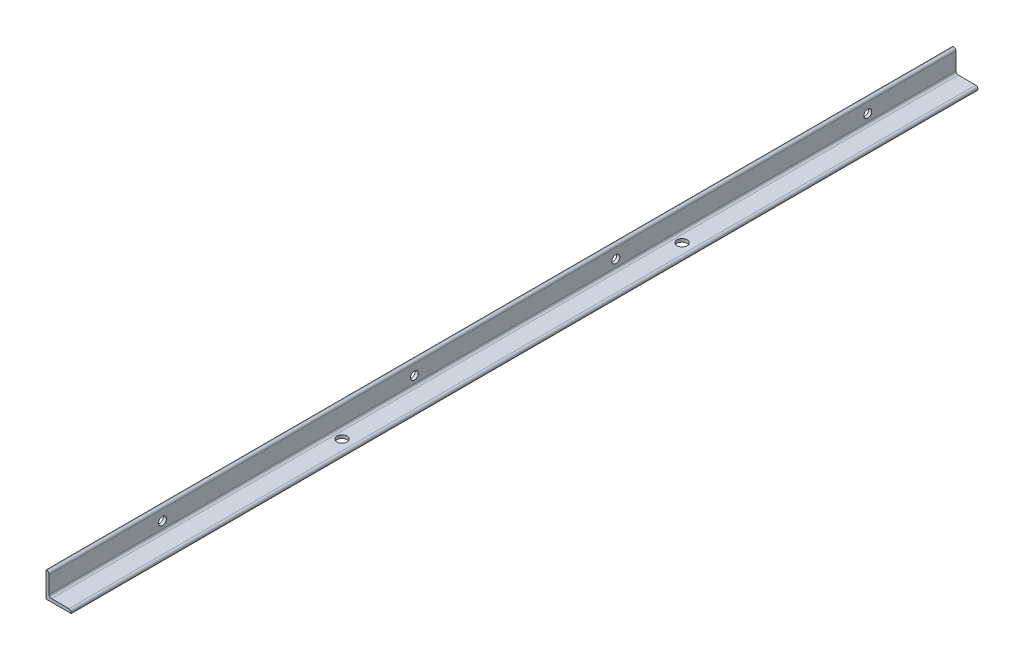
ISO-10303-21;
HEADER;
FILE_DESCRIPTION(('STEP AP214'),'2;1');
FILE_NAME('part.step','',(''),(''),'','','');
FILE_SCHEMA(('AUTOMOTIVE_DESIGN { 1 0 10303 214 1 1 1 1 }'));
ENDSEC;
DATA;
#1=APPLICATION_CONTEXT('core data for automotive mechanical design processes');
#2=APPLICATION_PROTOCOL_DEFINITION('international standard','automotive_design',2000,#1);
#3=PRODUCT_CONTEXT('',#1,'mechanical');
#4=PRODUCT('Part','Part','',(#3));
#5=PRODUCT_RELATED_PRODUCT_CATEGORY('part','',(#4));
#6=PRODUCT_DEFINITION_FORMATION('','',#4);
#7=PRODUCT_DEFINITION_CONTEXT('part definition',#1,'design');
#8=PRODUCT_DEFINITION('design','',#6,#7);
#9=PRODUCT_DEFINITION_SHAPE('','',#8);
#10=(LENGTH_UNIT() NAMED_UNIT(*) SI_UNIT(.MILLI.,.METRE.));
#11=(NAMED_UNIT(*) PLANE_ANGLE_UNIT() SI_UNIT($,.RADIAN.));
#12=(NAMED_UNIT(*) SI_UNIT($,.STERADIAN.) SOLID_ANGLE_UNIT());
#13=UNCERTAINTY_MEASURE_WITH_UNIT(LENGTH_MEASURE(1.E-05),#10,'distance_accuracy_value','');
#14=(GEOMETRIC_REPRESENTATION_CONTEXT(3) GLOBAL_UNCERTAINTY_ASSIGNED_CONTEXT((#13)) GLOBAL_UNIT_ASSIGNED_CONTEXT((#10,
#11,#12)) REPRESENTATION_CONTEXT('',''));
#15=CARTESIAN_POINT('',(0.,0.,0.));
#16=DIRECTION('',(0.,0.,1.));
#17=DIRECTION('',(1.,0.,0.));
#18=AXIS2_PLACEMENT_3D('',#15,#16,#17);
#19=CARTESIAN_POINT('',(0.,0.,914.4));
#20=DIRECTION('',(1.,0.,0.));
#21=DIRECTION('',(0.,1.,0.));
#22=AXIS2_PLACEMENT_3D('',#19,#20,#21);
#23=PLANE('',#22);
#24=CARTESIAN_POINT('',(0.,25.4,-736.6));
#25=DIRECTION('',(-1.,0.,0.));
#26=DIRECTION('',(0.,0.,1.));
#27=AXIS2_PLACEMENT_3D('',#24,#25,#26);
#28=CIRCLE('',#27,7.9375);
#29=CARTESIAN_POINT('',(0.,25.4,-728.6625));
#30=VERTEX_POINT('',#29);
#31=EDGE_CURVE('E210',#30,#30,#28,.T.);
#32=ORIENTED_EDGE('',*,*,#31,.F.);
#33=EDGE_LOOP('',(#32));
#34=FACE_BOUND('',#33,.T.);
#35=CARTESIAN_POINT('',(0.,25.4,-228.6));
#36=DIRECTION('',(-1.,0.,0.));
#37=DIRECTION('',(0.,0.,1.));
#38=AXIS2_PLACEMENT_3D('',#35,#36,#37);
#39=CIRCLE('',#38,7.9375);
#40=CARTESIAN_POINT('',(0.,25.4,-220.6625));
#41=VERTEX_POINT('',#40);
#42=EDGE_CURVE('E204',#41,#41,#39,.T.);
#43=ORIENTED_EDGE('',*,*,#42,.F.);
#44=EDGE_LOOP('',(#43));
#45=FACE_BOUND('',#44,.T.);
#46=CARTESIAN_POINT('',(0.,25.4,177.8));
#47=DIRECTION('',(-1.,0.,0.));
#48=DIRECTION('',(0.,0.,1.));
#49=AXIS2_PLACEMENT_3D('',#46,#47,#48);
#50=CIRCLE('',#49,7.9375);
#51=CARTESIAN_POINT('',(0.,25.4,185.7375));
#52=VERTEX_POINT('',#51);
#53=EDGE_CURVE('E198',#52,#52,#50,.T.);
#54=ORIENTED_EDGE('',*,*,#53,.F.);
#55=EDGE_LOOP('',(#54));
#56=FACE_BOUND('',#55,.T.);
#57=DIRECTION('',(0.,-1.,0.));
#58=VECTOR('',#57,1.);
#59=CARTESIAN_POINT('',(0.,0.,-914.4));
#60=LINE('',#59,#58);
#61=CARTESIAN_POINT('',(0.,50.8,-914.4));
#62=VERTEX_POINT('',#61);
#63=CARTESIAN_POINT('',(0.,0.,-914.4));
#64=VERTEX_POINT('',#63);
#65=EDGE_CURVE('E72',#62,#64,#60,.T.);
#66=ORIENTED_EDGE('',*,*,#65,.T.);
#67=DIRECTION('',(0.,0.,-1.));
#68=VECTOR('',#67,1.);
#69=CARTESIAN_POINT('',(0.,0.,914.4));
#70=LINE('',#69,#68);
#71=CARTESIAN_POINT('',(0.,0.,914.4));
#72=VERTEX_POINT('',#71);
#73=EDGE_CURVE('E116',#72,#64,#70,.T.);
#74=ORIENTED_EDGE('',*,*,#73,.F.);
#75=DIRECTION('',(0.,-1.,0.));
#76=VECTOR('',#75,1.);
#77=CARTESIAN_POINT('',(0.,0.,914.4));
#78=LINE('',#77,#76);
#79=CARTESIAN_POINT('',(0.,50.8,914.4));
#80=VERTEX_POINT('',#79);
#81=EDGE_CURVE('E34',#80,#72,#78,.T.);
#82=ORIENTED_EDGE('',*,*,#81,.F.);
#83=DIRECTION('',(0.,0.,-1.));
#84=VECTOR('',#83,1.);
#85=CARTESIAN_POINT('',(0.,50.8,914.4));
#86=LINE('',#85,#84);
#87=EDGE_CURVE('E112',#80,#62,#86,.T.);
#88=ORIENTED_EDGE('',*,*,#87,.T.);
#89=EDGE_LOOP('',(#66,#74,#82,#88));
#90=FACE_BOUND('',#89,.T.);
#91=CARTESIAN_POINT('',(0.,25.4,685.8));
#92=DIRECTION('',(-1.,0.,0.));
#93=DIRECTION('',(0.,0.,1.));
#94=AXIS2_PLACEMENT_3D('',#91,#92,#93);
#95=CIRCLE('',#94,7.9375);
#96=CARTESIAN_POINT('',(0.,25.4,693.7375));
#97=VERTEX_POINT('',#96);
#98=EDGE_CURVE('E192',#97,#97,#95,.T.);
#99=ORIENTED_EDGE('',*,*,#98,.F.);
#100=EDGE_LOOP('',(#99));
#101=FACE_BOUND('',#100,.T.);
#102=ADVANCED_FACE('F17',(#34,#45,#56,#90,#101),#23,.F.);
#103=CARTESIAN_POINT('',(50.8,0.,914.4));
#104=DIRECTION('',(0.,1.,0.));
#105=DIRECTION('',(0.,0.,1.));
#106=AXIS2_PLACEMENT_3D('',#103,#104,#105);
#107=PLANE('',#106);
#108=CARTESIAN_POINT('',(25.4,0.,342.9));
#109=DIRECTION('',(0.,-1.,0.));
#110=DIRECTION('',(0.,0.,-1.));
#111=AXIS2_PLACEMENT_3D('',#108,#109,#110);
#112=CIRCLE('',#111,10.31875);
#113=CARTESIAN_POINT('',(25.4,0.,332.58125));
#114=VERTEX_POINT('',#113);
#115=EDGE_CURVE('E180',#114,#114,#112,.T.);
#116=ORIENTED_EDGE('',*,*,#115,.F.);
#117=EDGE_LOOP('',(#116));
#118=FACE_BOUND('',#117,.T.);
#119=DIRECTION('',(1.,0.,0.));
#120=VECTOR('',#119,1.);
#121=CARTESIAN_POINT('',(50.8,0.,-914.4));
#122=LINE('',#121,#120);
#123=CARTESIAN_POINT('',(50.8,0.,-914.4));
#124=VERTEX_POINT('',#123);
#125=EDGE_CURVE('E120',#64,#124,#122,.T.);
#126=ORIENTED_EDGE('',*,*,#125,.T.);
#127=DIRECTION('',(0.,0.,-1.));
#128=VECTOR('',#127,1.);
#129=CARTESIAN_POINT('',(50.8,0.,914.4));
#130=LINE('',#129,#128);
#131=CARTESIAN_POINT('',(50.8,0.,914.4));
#132=VERTEX_POINT('',#131);
#133=EDGE_CURVE('E11',#132,#124,#130,.T.);
#134=ORIENTED_EDGE('',*,*,#133,.F.);
#135=DIRECTION('',(1.,0.,0.));
#136=VECTOR('',#135,1.);
#137=CARTESIAN_POINT('',(50.8,0.,914.4));
#138=LINE('',#137,#136);
#139=EDGE_CURVE('E137',#72,#132,#138,.T.);
#140=ORIENTED_EDGE('',*,*,#139,.F.);
#141=ORIENTED_EDGE('',*,*,#73,.T.);
#142=EDGE_LOOP('',(#126,#134,#140,#141));
#143=FACE_BOUND('',#142,.T.);
#144=CARTESIAN_POINT('',(25.4,0.,-342.9));
#145=DIRECTION('',(0.,-1.,0.));
#146=DIRECTION('',(0.,0.,-1.));
#147=AXIS2_PLACEMENT_3D('',#144,#145,#146);
#148=CIRCLE('',#147,10.31875);
#149=CARTESIAN_POINT('',(25.4,0.,-353.21875));
#150=VERTEX_POINT('',#149);
#151=EDGE_CURVE('E186',#150,#150,#148,.T.);
#152=ORIENTED_EDGE('',*,*,#151,.F.);
#153=EDGE_LOOP('',(#152));
#154=FACE_BOUND('',#153,.T.);
#155=ADVANCED_FACE('F19',(#118,#143,#154),#107,.F.);
#156=CARTESIAN_POINT('',(50.8,1.59258,914.4));
#157=DIRECTION('',(-1.,0.,0.));
#158=DIRECTION('',(0.,0.,1.));
#159=AXIS2_PLACEMENT_3D('',#156,#157,#158);
#160=PLANE('',#159);
#161=DIRECTION('',(0.,1.,0.));
#162=VECTOR('',#161,1.);
#163=CARTESIAN_POINT('',(50.8,1.59258,-914.4));
#164=LINE('',#163,#162);
#165=CARTESIAN_POINT('',(50.8,1.59258,-914.4));
#166=VERTEX_POINT('',#165);
#167=EDGE_CURVE('E123',#124,#166,#164,.T.);
#168=ORIENTED_EDGE('',*,*,#167,.T.);
#169=DIRECTION('',(0.,0.,-1.));
#170=VECTOR('',#169,1.);
#171=CARTESIAN_POINT('',(50.8,1.59258,914.4));
#172=LINE('',#171,#170);
#173=CARTESIAN_POINT('',(50.8,1.59258,914.4));
#174=VERTEX_POINT('',#173);
#175=EDGE_CURVE('E26',#174,#166,#172,.T.);
#176=ORIENTED_EDGE('',*,*,#175,.F.);
#177=DIRECTION('',(0.,1.,0.));
#178=VECTOR('',#177,1.);
#179=CARTESIAN_POINT('',(50.8,1.59258,914.4));
#180=LINE('',#179,#178);
#181=EDGE_CURVE('E80',#132,#174,#180,.T.);
#182=ORIENTED_EDGE('',*,*,#181,.F.);
#183=ORIENTED_EDGE('',*,*,#133,.T.);
#184=EDGE_LOOP('',(#168,#176,#182,#183));
#185=FACE_BOUND('',#184,.T.);
#186=ADVANCED_FACE('F267',(#185),#160,.F.);
#187=CARTESIAN_POINT('',(46.04258,1.59258,914.4));
#188=DIRECTION('',(0.,0.,-1.));
#189=DIRECTION('',(-1.,0.,0.));
#190=AXIS2_PLACEMENT_3D('',#187,#188,#189);
#191=CYLINDRICAL_SURFACE('',#190,4.75742);
#192=CARTESIAN_POINT('',(46.04258,1.59258,-914.4));
#193=DIRECTION('',(0.,0.,1.));
#194=DIRECTION('',(1.,0.,0.));
#195=AXIS2_PLACEMENT_3D('',#192,#193,#194);
#196=CIRCLE('',#195,4.75742);
#197=CARTESIAN_POINT('',(46.04258,6.35,-914.4));
#198=VERTEX_POINT('',#197);
#199=EDGE_CURVE('E126',#166,#198,#196,.T.);
#200=ORIENTED_EDGE('',*,*,#199,.T.);
#201=DIRECTION('',(0.,0.,-1.));
#202=VECTOR('',#201,1.);
#203=CARTESIAN_POINT('',(46.04258,6.35,914.4));
#204=LINE('',#203,#202);
#205=CARTESIAN_POINT('',(46.04258,6.35,914.4));
#206=VERTEX_POINT('',#205);
#207=EDGE_CURVE('E147',#206,#198,#204,.T.);
#208=ORIENTED_EDGE('',*,*,#207,.F.);
#209=CARTESIAN_POINT('',(46.04258,1.59258,914.4));
#210=DIRECTION('',(0.,0.,1.));
#211=DIRECTION('',(1.,0.,0.));
#212=AXIS2_PLACEMENT_3D('',#209,#210,#211);
#213=CIRCLE('',#212,4.75742);
#214=EDGE_CURVE('E155',#174,#206,#213,.T.);
#215=ORIENTED_EDGE('',*,*,#214,.F.);
#216=ORIENTED_EDGE('',*,*,#175,.T.);
#217=EDGE_LOOP('',(#200,#208,#215,#216));
#218=FACE_BOUND('',#217,.T.);
#219=ADVANCED_FACE('F153',(#218),#191,.T.);
#220=CARTESIAN_POINT('',(11.1125,6.35,914.4));
#221=DIRECTION('',(0.,-1.,0.));
#222=DIRECTION('',(0.,0.,-1.));
#223=AXIS2_PLACEMENT_3D('',#220,#221,#222);
#224=PLANE('',#223);
#225=CARTESIAN_POINT('',(25.4,6.35,-342.9));
#226=DIRECTION('',(0.,-1.,0.));
#227=DIRECTION('',(0.,0.,-1.));
#228=AXIS2_PLACEMENT_3D('',#225,#226,#227);
#229=CIRCLE('',#228,10.31875);
#230=CARTESIAN_POINT('',(25.4,6.35,-353.21875));
#231=VERTEX_POINT('',#230);
#232=EDGE_CURVE('E183',#231,#231,#229,.T.);
#233=ORIENTED_EDGE('',*,*,#232,.T.);
#234=EDGE_LOOP('',(#233));
#235=FACE_BOUND('',#234,.T.);
#236=CARTESIAN_POINT('',(25.4,6.35,342.9));
#237=DIRECTION('',(0.,-1.,0.));
#238=DIRECTION('',(0.,0.,-1.));
#239=AXIS2_PLACEMENT_3D('',#236,#237,#238);
#240=CIRCLE('',#239,10.31875);
#241=CARTESIAN_POINT('',(25.4,6.35,332.58125));
#242=VERTEX_POINT('',#241);
#243=EDGE_CURVE('E124',#242,#242,#240,.T.);
#244=ORIENTED_EDGE('',*,*,#243,.T.);
#245=EDGE_LOOP('',(#244));
#246=FACE_BOUND('',#245,.T.);
#247=DIRECTION('',(-1.,0.,0.));
#248=VECTOR('',#247,1.);
#249=CARTESIAN_POINT('',(11.1125,6.35,-914.4));
#250=LINE('',#249,#248);
#251=CARTESIAN_POINT('',(11.1125,6.35,-914.4));
#252=VERTEX_POINT('',#251);
#253=EDGE_CURVE('E128',#198,#252,#250,.T.);
#254=ORIENTED_EDGE('',*,*,#253,.T.);
#255=DIRECTION('',(0.,0.,-1.));
#256=VECTOR('',#255,1.);
#257=CARTESIAN_POINT('',(11.1125,6.35,914.4));
#258=LINE('',#257,#256);
#259=CARTESIAN_POINT('',(11.1125,6.35,914.4));
#260=VERTEX_POINT('',#259);
#261=EDGE_CURVE('E144',#260,#252,#258,.T.);
#262=ORIENTED_EDGE('',*,*,#261,.F.);
#263=DIRECTION('',(-1.,0.,0.));
#264=VECTOR('',#263,1.);
#265=CARTESIAN_POINT('',(11.1125,6.35,914.4));
#266=LINE('',#265,#264);
#267=EDGE_CURVE('E171',#206,#260,#266,.T.);
#268=ORIENTED_EDGE('',*,*,#267,.F.);
#269=ORIENTED_EDGE('',*,*,#207,.T.);
#270=EDGE_LOOP('',(#254,#262,#268,#269));
#271=FACE_BOUND('',#270,.T.);
#272=ADVANCED_FACE('F164',(#235,#246,#271),#224,.F.);
#273=CARTESIAN_POINT('',(11.1125,11.1125,914.4));
#274=DIRECTION('',(0.,0.,-1.));
#275=DIRECTION('',(-1.,0.,0.));
#276=AXIS2_PLACEMENT_3D('',#273,#274,#275);
#277=CYLINDRICAL_SURFACE('',#276,4.7625);
#278=CARTESIAN_POINT('',(11.1125,11.1125,-914.4));
#279=DIRECTION('',(0.,0.,-1.));
#280=DIRECTION('',(-1.,0.,0.));
#281=AXIS2_PLACEMENT_3D('',#278,#279,#280);
#282=CIRCLE('',#281,4.7625);
#283=CARTESIAN_POINT('',(6.35,11.1125,-914.4));
#284=VERTEX_POINT('',#283);
#285=EDGE_CURVE('E130',#252,#284,#282,.T.);
#286=ORIENTED_EDGE('',*,*,#285,.T.);
#287=DIRECTION('',(0.,0.,-1.));
#288=VECTOR('',#287,1.);
#289=CARTESIAN_POINT('',(6.35,11.1125,914.4));
#290=LINE('',#289,#288);
#291=CARTESIAN_POINT('',(6.35,11.1125,914.4));
#292=VERTEX_POINT('',#291);
#293=EDGE_CURVE('E141',#292,#284,#290,.T.);
#294=ORIENTED_EDGE('',*,*,#293,.F.);
#295=CARTESIAN_POINT('',(11.1125,11.1125,914.4));
#296=DIRECTION('',(0.,0.,-1.));
#297=DIRECTION('',(-1.,0.,0.));
#298=AXIS2_PLACEMENT_3D('',#295,#296,#297);
#299=CIRCLE('',#298,4.7625);
#300=EDGE_CURVE('E170',#260,#292,#299,.T.);
#301=ORIENTED_EDGE('',*,*,#300,.F.);
#302=ORIENTED_EDGE('',*,*,#261,.T.);
#303=EDGE_LOOP('',(#286,#294,#301,#302));
#304=FACE_BOUND('',#303,.T.);
#305=ADVANCED_FACE('F168',(#304),#277,.F.);
#306=CARTESIAN_POINT('',(6.35,46.04258,914.4));
#307=DIRECTION('',(-1.,0.,0.));
#308=DIRECTION('',(0.,-1.,0.));
#309=AXIS2_PLACEMENT_3D('',#306,#307,#308);
#310=PLANE('',#309);
#311=CARTESIAN_POINT('',(6.35,25.4,-736.6));
#312=DIRECTION('',(-1.,0.,0.));
#313=DIRECTION('',(0.,-1.,0.));
#314=AXIS2_PLACEMENT_3D('',#311,#312,#313);
#315=CIRCLE('',#314,7.9375);
#316=CARTESIAN_POINT('',(6.35,17.4625,-736.6));
#317=VERTEX_POINT('',#316);
#318=EDGE_CURVE('E207',#317,#317,#315,.T.);
#319=ORIENTED_EDGE('',*,*,#318,.T.);
#320=EDGE_LOOP('',(#319));
#321=FACE_BOUND('',#320,.T.);
#322=CARTESIAN_POINT('',(6.35,25.4,-228.6));
#323=DIRECTION('',(-1.,0.,0.));
#324=DIRECTION('',(0.,-1.,0.));
#325=AXIS2_PLACEMENT_3D('',#322,#323,#324);
#326=CIRCLE('',#325,7.9375);
#327=CARTESIAN_POINT('',(6.35,17.4625,-228.6));
#328=VERTEX_POINT('',#327);
#329=EDGE_CURVE('E201',#328,#328,#326,.T.);
#330=ORIENTED_EDGE('',*,*,#329,.T.);
#331=EDGE_LOOP('',(#330));
#332=FACE_BOUND('',#331,.T.);
#333=CARTESIAN_POINT('',(6.35,25.4,177.8));
#334=DIRECTION('',(-1.,0.,0.));
#335=DIRECTION('',(0.,-1.,0.));
#336=AXIS2_PLACEMENT_3D('',#333,#334,#335);
#337=CIRCLE('',#336,7.9375);
#338=CARTESIAN_POINT('',(6.35,17.4625,177.8));
#339=VERTEX_POINT('',#338);
#340=EDGE_CURVE('E195',#339,#339,#337,.T.);
#341=ORIENTED_EDGE('',*,*,#340,.T.);
#342=EDGE_LOOP('',(#341));
#343=FACE_BOUND('',#342,.T.);
#344=CARTESIAN_POINT('',(6.35,25.4,685.8));
#345=DIRECTION('',(-1.,0.,0.));
#346=DIRECTION('',(0.,-1.,0.));
#347=AXIS2_PLACEMENT_3D('',#344,#345,#346);
#348=CIRCLE('',#347,7.9375);
#349=CARTESIAN_POINT('',(6.35,17.4625,685.8));
#350=VERTEX_POINT('',#349);
#351=EDGE_CURVE('E189',#350,#350,#348,.T.);
#352=ORIENTED_EDGE('',*,*,#351,.T.);
#353=EDGE_LOOP('',(#352));
#354=FACE_BOUND('',#353,.T.);
#355=DIRECTION('',(0.,1.,0.));
#356=VECTOR('',#355,1.);
#357=CARTESIAN_POINT('',(6.35,46.04258,-914.4));
#358=LINE('',#357,#356);
#359=CARTESIAN_POINT('',(6.35,46.04258,-914.4));
#360=VERTEX_POINT('',#359);
#361=EDGE_CURVE('E132',#284,#360,#358,.T.);
#362=ORIENTED_EDGE('',*,*,#361,.T.);
#363=DIRECTION('',(0.,0.,-1.));
#364=VECTOR('',#363,1.);
#365=CARTESIAN_POINT('',(6.35,46.04258,914.4));
#366=LINE('',#365,#364);
#367=CARTESIAN_POINT('',(6.35,46.04258,914.4));
#368=VERTEX_POINT('',#367);
#369=EDGE_CURVE('E111',#368,#360,#366,.T.);
#370=ORIENTED_EDGE('',*,*,#369,.F.);
#371=DIRECTION('',(0.,1.,0.));
#372=VECTOR('',#371,1.);
#373=CARTESIAN_POINT('',(6.35,46.04258,914.4));
#374=LINE('',#373,#372);
#375=EDGE_CURVE('E102',#292,#368,#374,.T.);
#376=ORIENTED_EDGE('',*,*,#375,.F.);
#377=ORIENTED_EDGE('',*,*,#293,.T.);
#378=EDGE_LOOP('',(#362,#370,#376,#377));
#379=FACE_BOUND('',#378,.T.);
#380=ADVANCED_FACE('F257',(#321,#332,#343,#354,#379),#310,.F.);
#381=CARTESIAN_POINT('',(1.59258,46.04258,914.4));
#382=DIRECTION('',(0.,0.,-1.));
#383=DIRECTION('',(-1.,0.,0.));
#384=AXIS2_PLACEMENT_3D('',#381,#382,#383);
#385=CYLINDRICAL_SURFACE('',#384,4.75742);
#386=CARTESIAN_POINT('',(1.59258,46.04258,-914.4));
#387=DIRECTION('',(0.,0.,1.));
#388=DIRECTION('',(-1.,0.,0.));
#389=AXIS2_PLACEMENT_3D('',#386,#387,#388);
#390=CIRCLE('',#389,4.75742);
#391=CARTESIAN_POINT('',(1.59258,50.8,-914.4));
#392=VERTEX_POINT('',#391);
#393=EDGE_CURVE('E110',#360,#392,#390,.T.);
#394=ORIENTED_EDGE('',*,*,#393,.T.);
#395=DIRECTION('',(0.,0.,-1.));
#396=VECTOR('',#395,1.);
#397=CARTESIAN_POINT('',(1.59258,50.8,914.4));
#398=LINE('',#397,#396);
#399=CARTESIAN_POINT('',(1.59258,50.8,914.4));
#400=VERTEX_POINT('',#399);
#401=EDGE_CURVE('E107',#400,#392,#398,.T.);
#402=ORIENTED_EDGE('',*,*,#401,.F.);
#403=CARTESIAN_POINT('',(1.59258,46.04258,914.4));
#404=DIRECTION('',(0.,0.,1.));
#405=DIRECTION('',(-1.,0.,0.));
#406=AXIS2_PLACEMENT_3D('',#403,#404,#405);
#407=CIRCLE('',#406,4.75742);
#408=EDGE_CURVE('E96',#368,#400,#407,.T.);
#409=ORIENTED_EDGE('',*,*,#408,.F.);
#410=ORIENTED_EDGE('',*,*,#369,.T.);
#411=EDGE_LOOP('',(#394,#402,#409,#410));
#412=FACE_BOUND('',#411,.T.);
#413=ADVANCED_FACE('F108',(#412),#385,.T.);
#414=CARTESIAN_POINT('',(0.,50.8,914.4));
#415=DIRECTION('',(0.,-1.,0.));
#416=DIRECTION('',(0.,0.,-1.));
#417=AXIS2_PLACEMENT_3D('',#414,#415,#416);
#418=PLANE('',#417);
#419=DIRECTION('',(-1.,0.,0.));
#420=VECTOR('',#419,1.);
#421=CARTESIAN_POINT('',(0.,50.8,-914.4));
#422=LINE('',#421,#420);
#423=EDGE_CURVE('E66',#392,#62,#422,.T.);
#424=ORIENTED_EDGE('',*,*,#423,.T.);
#425=ORIENTED_EDGE('',*,*,#87,.F.);
#426=DIRECTION('',(-1.,0.,0.));
#427=VECTOR('',#426,1.);
#428=CARTESIAN_POINT('',(0.,50.8,914.4));
#429=LINE('',#428,#427);
#430=EDGE_CURVE('E100',#400,#80,#429,.T.);
#431=ORIENTED_EDGE('',*,*,#430,.F.);
#432=ORIENTED_EDGE('',*,*,#401,.T.);
#433=EDGE_LOOP('',(#424,#425,#431,#432));
#434=FACE_BOUND('',#433,.T.);
#435=ADVANCED_FACE('F114',(#434),#418,.F.);
#436=CARTESIAN_POINT('',(1.59258,46.04258,914.4));
#437=DIRECTION('',(0.,0.,-1.));
#438=DIRECTION('',(-1.,0.,0.));
#439=AXIS2_PLACEMENT_3D('',#436,#437,#438);
#440=PLANE('',#439);
#441=ORIENTED_EDGE('',*,*,#139,.T.);
#442=ORIENTED_EDGE('',*,*,#181,.T.);
#443=ORIENTED_EDGE('',*,*,#214,.T.);
#444=ORIENTED_EDGE('',*,*,#267,.T.);
#445=ORIENTED_EDGE('',*,*,#300,.T.);
#446=ORIENTED_EDGE('',*,*,#375,.T.);
#447=ORIENTED_EDGE('',*,*,#408,.T.);
#448=ORIENTED_EDGE('',*,*,#430,.T.);
#449=ORIENTED_EDGE('',*,*,#81,.T.);
#450=EDGE_LOOP('',(#441,#442,#443,#444,#445,#446,#447,#448,#449));
#451=FACE_BOUND('',#450,.T.);
#452=ADVANCED_FACE('F98',(#451),#440,.F.);
#453=CARTESIAN_POINT('',(1.59258,46.04258,-914.4));
#454=DIRECTION('',(0.,0.,-1.));
#455=DIRECTION('',(-1.,0.,0.));
#456=AXIS2_PLACEMENT_3D('',#453,#454,#455);
#457=PLANE('',#456);
#458=ORIENTED_EDGE('',*,*,#125,.F.);
#459=ORIENTED_EDGE('',*,*,#65,.F.);
#460=ORIENTED_EDGE('',*,*,#423,.F.);
#461=ORIENTED_EDGE('',*,*,#393,.F.);
#462=ORIENTED_EDGE('',*,*,#361,.F.);
#463=ORIENTED_EDGE('',*,*,#285,.F.);
#464=ORIENTED_EDGE('',*,*,#253,.F.);
#465=ORIENTED_EDGE('',*,*,#199,.F.);
#466=ORIENTED_EDGE('',*,*,#167,.F.);
#467=EDGE_LOOP('',(#458,#459,#460,#461,#462,#463,#464,#465,#466));
#468=FACE_BOUND('',#467,.T.);
#469=ADVANCED_FACE('F159',(#468),#457,.T.);
#470=CARTESIAN_POINT('',(25.4,0.,342.9));
#471=DIRECTION('',(0.,-1.,0.));
#472=DIRECTION('',(0.,0.,-1.));
#473=AXIS2_PLACEMENT_3D('',#470,#471,#472);
#474=CYLINDRICAL_SURFACE('',#473,10.31875);
#475=ORIENTED_EDGE('',*,*,#243,.F.);
#476=EDGE_LOOP('',(#475));
#477=FACE_BOUND('',#476,.T.);
#478=ORIENTED_EDGE('',*,*,#115,.T.);
#479=EDGE_LOOP('',(#478));
#480=FACE_BOUND('',#479,.T.);
#481=ADVANCED_FACE('F240',(#477,#480),#474,.F.);
#482=CARTESIAN_POINT('',(25.4,0.,-342.9));
#483=DIRECTION('',(0.,-1.,0.));
#484=DIRECTION('',(0.,0.,-1.));
#485=AXIS2_PLACEMENT_3D('',#482,#483,#484);
#486=CYLINDRICAL_SURFACE('',#485,10.31875);
#487=ORIENTED_EDGE('',*,*,#232,.F.);
#488=EDGE_LOOP('',(#487));
#489=FACE_BOUND('',#488,.T.);
#490=ORIENTED_EDGE('',*,*,#151,.T.);
#491=EDGE_LOOP('',(#490));
#492=FACE_BOUND('',#491,.T.);
#493=ADVANCED_FACE('F228',(#489,#492),#486,.F.);
#494=CARTESIAN_POINT('',(0.,25.4,685.8));
#495=DIRECTION('',(-1.,0.,0.));
#496=DIRECTION('',(0.,0.,1.));
#497=AXIS2_PLACEMENT_3D('',#494,#495,#496);
#498=CYLINDRICAL_SURFACE('',#497,7.9375);
#499=ORIENTED_EDGE('',*,*,#351,.F.);
#500=EDGE_LOOP('',(#499));
#501=FACE_BOUND('',#500,.T.);
#502=ORIENTED_EDGE('',*,*,#98,.T.);
#503=EDGE_LOOP('',(#502));
#504=FACE_BOUND('',#503,.T.);
#505=ADVANCED_FACE('F225',(#501,#504),#498,.F.);
#506=CARTESIAN_POINT('',(0.,25.4,177.8));
#507=DIRECTION('',(-1.,0.,0.));
#508=DIRECTION('',(0.,0.,1.));
#509=AXIS2_PLACEMENT_3D('',#506,#507,#508);
#510=CYLINDRICAL_SURFACE('',#509,7.9375);
#511=ORIENTED_EDGE('',*,*,#340,.F.);
#512=EDGE_LOOP('',(#511));
#513=FACE_BOUND('',#512,.T.);
#514=ORIENTED_EDGE('',*,*,#53,.T.);
#515=EDGE_LOOP('',(#514));
#516=FACE_BOUND('',#515,.T.);
#517=ADVANCED_FACE('F227',(#513,#516),#510,.F.);
#518=CARTESIAN_POINT('',(0.,25.4,-228.6));
#519=DIRECTION('',(-1.,0.,0.));
#520=DIRECTION('',(0.,0.,1.));
#521=AXIS2_PLACEMENT_3D('',#518,#519,#520);
#522=CYLINDRICAL_SURFACE('',#521,7.9375);
#523=ORIENTED_EDGE('',*,*,#329,.F.);
#524=EDGE_LOOP('',(#523));
#525=FACE_BOUND('',#524,.T.);
#526=ORIENTED_EDGE('',*,*,#42,.T.);
#527=EDGE_LOOP('',(#526));
#528=FACE_BOUND('',#527,.T.);
#529=ADVANCED_FACE('F237',(#525,#528),#522,.F.);
#530=CARTESIAN_POINT('',(0.,25.4,-736.6));
#531=DIRECTION('',(-1.,0.,0.));
#532=DIRECTION('',(0.,0.,1.));
#533=AXIS2_PLACEMENT_3D('',#530,#531,#532);
#534=CYLINDRICAL_SURFACE('',#533,7.9375);
#535=ORIENTED_EDGE('',*,*,#318,.F.);
#536=EDGE_LOOP('',(#535));
#537=FACE_BOUND('',#536,.T.);
#538=ORIENTED_EDGE('',*,*,#31,.T.);
#539=EDGE_LOOP('',(#538));
#540=FACE_BOUND('',#539,.T.);
#541=ADVANCED_FACE('F214',(#537,#540),#534,.F.);
#542=CLOSED_SHELL('',(#102,#155,#186,#219,#272,#305,#380,#413,#435,#452,#469,#481,#493,#505,
#517,#529,#541));
#543=MANIFOLD_SOLID_BREP('B1',#542);
#544=ADVANCED_BREP_SHAPE_REPRESENTATION('',(#18,#543),#14);
#545=SHAPE_DEFINITION_REPRESENTATION(#9,#544);
ENDSEC;
END-ISO-10303-21;
